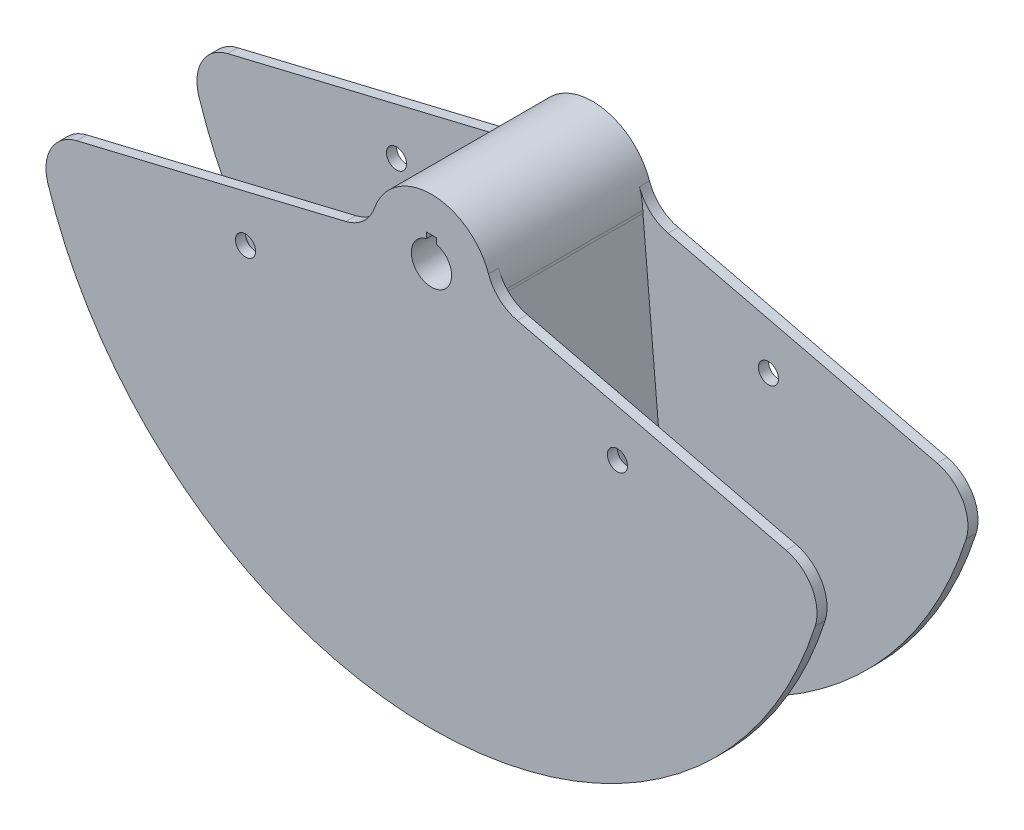
ISO-10303-21;
HEADER;
FILE_DESCRIPTION(('STEP AP214'),'2;1');
FILE_NAME('part.step','',(''),(''),'','','');
FILE_SCHEMA(('AUTOMOTIVE_DESIGN { 1 0 10303 214 1 1 1 1 }'));
ENDSEC;
DATA;
#1=APPLICATION_CONTEXT('core data for automotive mechanical design processes');
#2=APPLICATION_PROTOCOL_DEFINITION('international standard','automotive_design',2000,#1);
#3=PRODUCT_CONTEXT('',#1,'mechanical');
#4=PRODUCT('Part','Part','',(#3));
#5=PRODUCT_RELATED_PRODUCT_CATEGORY('part','',(#4));
#6=PRODUCT_DEFINITION_FORMATION('','',#4);
#7=PRODUCT_DEFINITION_CONTEXT('part definition',#1,'design');
#8=PRODUCT_DEFINITION('design','',#6,#7);
#9=PRODUCT_DEFINITION_SHAPE('','',#8);
#10=(LENGTH_UNIT() NAMED_UNIT(*) SI_UNIT(.MILLI.,.METRE.));
#11=(NAMED_UNIT(*) PLANE_ANGLE_UNIT() SI_UNIT($,.RADIAN.));
#12=(NAMED_UNIT(*) SI_UNIT($,.STERADIAN.) SOLID_ANGLE_UNIT());
#13=UNCERTAINTY_MEASURE_WITH_UNIT(LENGTH_MEASURE(1.E-05),#10,'distance_accuracy_value','');
#14=(GEOMETRIC_REPRESENTATION_CONTEXT(3) GLOBAL_UNCERTAINTY_ASSIGNED_CONTEXT((#13)) GLOBAL_UNIT_ASSIGNED_CONTEXT((#10,
#11,#12)) REPRESENTATION_CONTEXT('',''));
#15=CARTESIAN_POINT('',(0.,0.,0.));
#16=DIRECTION('',(0.,0.,1.));
#17=DIRECTION('',(1.,0.,0.));
#18=AXIS2_PLACEMENT_3D('',#15,#16,#17);
#19=CARTESIAN_POINT('',(0.,0.,44.45));
#20=DIRECTION('',(0.,0.,-1.));
#21=DIRECTION('',(-1.,0.,0.));
#22=AXIS2_PLACEMENT_3D('',#19,#20,#21);
#23=CYLINDRICAL_SURFACE('',#22,12.7);
#24=CARTESIAN_POINT('',(0.,0.,-50.8));
#25=DIRECTION('',(0.,0.,1.));
#26=DIRECTION('',(1.,0.,0.));
#27=AXIS2_PLACEMENT_3D('',#24,#25,#26);
#28=CIRCLE('',#27,12.7);
#29=CARTESIAN_POINT('',(-3.175,12.2967221242086,-50.8));
#30=VERTEX_POINT('',#29);
#31=CARTESIAN_POINT('',(3.175,12.2967221242086,-50.8));
#32=VERTEX_POINT('',#31);
#33=EDGE_CURVE('E246',#30,#32,#28,.T.);
#34=ORIENTED_EDGE('',*,*,#33,.F.);
#35=DIRECTION('',(0.,0.,-1.));
#36=VECTOR('',#35,1.);
#37=CARTESIAN_POINT('',(-3.175,12.2967221242085,44.45));
#38=LINE('',#37,#36);
#39=CARTESIAN_POINT('',(-3.175,12.2967221242085,50.8));
#40=VERTEX_POINT('',#39);
#41=EDGE_CURVE('E229',#30,#40,#38,.F.);
#42=ORIENTED_EDGE('',*,*,#41,.T.);
#43=CARTESIAN_POINT('',(0.,0.,50.8));
#44=DIRECTION('',(0.,0.,1.));
#45=DIRECTION('',(1.,0.,0.));
#46=AXIS2_PLACEMENT_3D('',#43,#44,#45);
#47=CIRCLE('',#46,12.7);
#48=CARTESIAN_POINT('',(3.175,12.2967221242085,50.8));
#49=VERTEX_POINT('',#48);
#50=EDGE_CURVE('E390',#40,#49,#47,.T.);
#51=ORIENTED_EDGE('',*,*,#50,.T.);
#52=DIRECTION('',(0.,0.,-1.));
#53=VECTOR('',#52,1.);
#54=CARTESIAN_POINT('',(3.175,12.2967221242085,44.45));
#55=LINE('',#54,#53);
#56=EDGE_CURVE('E211',#32,#49,#55,.F.);
#57=ORIENTED_EDGE('',*,*,#56,.F.);
#58=EDGE_LOOP('',(#34,#42,#51,#57));
#59=FACE_BOUND('',#58,.T.);
#60=ADVANCED_FACE('F37',(#59),#23,.F.);
#61=CARTESIAN_POINT('',(59.9721936818723,20.8706968015925,50.8));
#62=DIRECTION('',(0.,0.,-1.));
#63=DIRECTION('',(-1.,0.,0.));
#64=AXIS2_PLACEMENT_3D('',#61,#62,#63);
#65=PLANE('',#64);
#66=CARTESIAN_POINT('',(117.332700628933,-48.6007959103665,50.8));
#67=DIRECTION('',(0.,0.,1.));
#68=DIRECTION('',(1.,0.,0.));
#69=AXIS2_PLACEMENT_3D('',#66,#67,#68);
#70=CIRCLE('',#69,6.35000000000002);
#71=CARTESIAN_POINT('',(123.682700628933,-48.6007959103665,50.8));
#72=VERTEX_POINT('',#71);
#73=EDGE_CURVE('E483',#72,#72,#70,.T.);
#74=ORIENTED_EDGE('',*,*,#73,.F.);
#75=EDGE_LOOP('',(#74));
#76=FACE_BOUND('',#75,.T.);
#77=CARTESIAN_POINT('',(-117.332700628933,-48.6007959103665,50.8));
#78=DIRECTION('',(0.,0.,1.));
#79=DIRECTION('',(1.,0.,0.));
#80=AXIS2_PLACEMENT_3D('',#77,#78,#79);
#81=CIRCLE('',#80,6.35);
#82=CARTESIAN_POINT('',(-110.982700628933,-48.6007959103665,50.8));
#83=VERTEX_POINT('',#82);
#84=EDGE_CURVE('E479',#83,#83,#81,.T.);
#85=ORIENTED_EDGE('',*,*,#84,.F.);
#86=EDGE_LOOP('',(#85));
#87=FACE_BOUND('',#86,.T.);
#88=CARTESIAN_POINT('',(59.9721936818723,20.8706968015925,50.8));
#89=DIRECTION('',(0.,0.,-1.));
#90=DIRECTION('',(-1.,0.,0.));
#91=AXIS2_PLACEMENT_3D('',#88,#89,#90);
#92=CIRCLE('',#91,25.4);
#93=CARTESIAN_POINT('',(54.0426814399322,-3.82749917650851,50.8));
#94=VERTEX_POINT('',#93);
#95=CARTESIAN_POINT('',(35.9833162091234,12.5224180809555,50.8));
#96=VERTEX_POINT('',#95);
#97=EDGE_CURVE('E440',#94,#96,#92,.T.);
#98=ORIENTED_EDGE('',*,*,#97,.T.);
#99=CARTESIAN_POINT('',(0.,0.,50.8));
#100=DIRECTION('',(0.,0.,1.));
#101=DIRECTION('',(1.,0.,0.));
#102=AXIS2_PLACEMENT_3D('',#99,#100,#101);
#103=CIRCLE('',#102,38.1);
#104=CARTESIAN_POINT('',(-35.9833162091234,12.5224180809555,50.8));
#105=VERTEX_POINT('',#104);
#106=EDGE_CURVE('E445',#96,#105,#103,.T.);
#107=ORIENTED_EDGE('',*,*,#106,.T.);
#108=CARTESIAN_POINT('',(-59.9721936818723,20.8706968015924,50.8));
#109=DIRECTION('',(0.,0.,-1.));
#110=DIRECTION('',(1.,0.,0.));
#111=AXIS2_PLACEMENT_3D('',#108,#109,#110);
#112=CIRCLE('',#111,25.4);
#113=CARTESIAN_POINT('',(-54.0426814399322,-3.82749917650852,50.8));
#114=VERTEX_POINT('',#113);
#115=EDGE_CURVE('E475',#105,#114,#112,.T.);
#116=ORIENTED_EDGE('',*,*,#115,.T.);
#117=DIRECTION('',(-0.972369920397677,-0.233445363855906,0.));
#118=VECTOR('',#117,1.);
#119=CARTESIAN_POINT('',(-223.779910529454,-44.5778025060183,50.8));
#120=LINE('',#119,#118);
#121=CARTESIAN_POINT('',(-223.779910529454,-44.5778025060183,50.8));
#122=VERTEX_POINT('',#121);
#123=EDGE_CURVE('E473',#114,#122,#120,.T.);
#124=ORIENTED_EDGE('',*,*,#123,.T.);
#125=CARTESIAN_POINT('',(-217.850398287514,-69.2759984841193,50.8));
#126=DIRECTION('',(0.,0.,1.));
#127=DIRECTION('',(1.,0.,0.));
#128=AXIS2_PLACEMENT_3D('',#125,#126,#127);
#129=CIRCLE('',#128,25.4);
#130=CARTESIAN_POINT('',(-242.055998097237,-76.9733316490214,50.8));
#131=VERTEX_POINT('',#130);
#132=EDGE_CURVE('E469',#122,#131,#129,.T.);
#133=ORIENTED_EDGE('',*,*,#132,.T.);
#134=CARTESIAN_POINT('',(0.,0.,50.8));
#135=DIRECTION('',(0.,0.,1.));
#136=DIRECTION('',(1.,0.,0.));
#137=AXIS2_PLACEMENT_3D('',#134,#135,#136);
#138=CIRCLE('',#137,254.);
#139=CARTESIAN_POINT('',(242.055998097237,-76.9733316490214,50.8));
#140=VERTEX_POINT('',#139);
#141=EDGE_CURVE('E468',#131,#140,#138,.T.);
#142=ORIENTED_EDGE('',*,*,#141,.T.);
#143=CARTESIAN_POINT('',(217.850398287514,-69.2759984841192,50.8));
#144=DIRECTION('',(0.,0.,1.));
#145=DIRECTION('',(-1.,0.,0.));
#146=AXIS2_PLACEMENT_3D('',#143,#144,#145);
#147=CIRCLE('',#146,25.4);
#148=CARTESIAN_POINT('',(223.779910529454,-44.5778025060183,50.8));
#149=VERTEX_POINT('',#148);
#150=EDGE_CURVE('E467',#140,#149,#147,.T.);
#151=ORIENTED_EDGE('',*,*,#150,.T.);
#152=DIRECTION('',(-0.972369920397677,0.233445363855906,0.));
#153=VECTOR('',#152,1.);
#154=CARTESIAN_POINT('',(54.0426814399322,-3.82749917650851,50.8));
#155=LINE('',#154,#153);
#156=EDGE_CURVE('E413',#149,#94,#155,.T.);
#157=ORIENTED_EDGE('',*,*,#156,.T.);
#158=EDGE_LOOP('',(#98,#107,#116,#124,#133,#142,#151,#157));
#159=FACE_BOUND('',#158,.T.);
#160=DIRECTION('',(0.,-1.,0.));
#161=VECTOR('',#160,1.);
#162=CARTESIAN_POINT('',(-3.175,20.8706968015925,50.8));
#163=LINE('',#162,#161);
#164=CARTESIAN_POINT('',(-3.175,15.875,50.8));
#165=VERTEX_POINT('',#164);
#166=EDGE_CURVE('E228',#165,#40,#163,.T.);
#167=ORIENTED_EDGE('',*,*,#166,.F.);
#168=DIRECTION('',(1.,0.,0.));
#169=VECTOR('',#168,1.);
#170=CARTESIAN_POINT('',(59.9721936818723,15.875,50.8));
#171=LINE('',#170,#169);
#172=CARTESIAN_POINT('',(3.175,15.875,50.8));
#173=VERTEX_POINT('',#172);
#174=EDGE_CURVE('E216',#165,#173,#171,.T.);
#175=ORIENTED_EDGE('',*,*,#174,.T.);
#176=DIRECTION('',(0.,-1.,0.));
#177=VECTOR('',#176,1.);
#178=CARTESIAN_POINT('',(3.175,20.8706968015925,50.8));
#179=LINE('',#178,#177);
#180=EDGE_CURVE('E208',#173,#49,#179,.T.);
#181=ORIENTED_EDGE('',*,*,#180,.T.);
#182=ORIENTED_EDGE('',*,*,#50,.F.);
#183=EDGE_LOOP('',(#167,#175,#181,#182));
#184=FACE_BOUND('',#183,.T.);
#185=ADVANCED_FACE('F227',(#76,#87,#159,#184),#65,.F.);
#186=CARTESIAN_POINT('',(59.9721936818723,20.8706968015925,-50.8));
#187=DIRECTION('',(0.,0.,1.));
#188=DIRECTION('',(-1.,0.,0.));
#189=AXIS2_PLACEMENT_3D('',#186,#187,#188);
#190=PLANE('',#189);
#191=CARTESIAN_POINT('',(59.9721936818723,20.8706968015925,-50.8));
#192=DIRECTION('',(0.,0.,-1.));
#193=DIRECTION('',(-1.,0.,0.));
#194=AXIS2_PLACEMENT_3D('',#191,#192,#193);
#195=CIRCLE('',#194,25.4);
#196=CARTESIAN_POINT('',(54.0426814399322,-3.82749917650851,-50.8));
#197=VERTEX_POINT('',#196);
#198=CARTESIAN_POINT('',(35.9833162091234,12.5224180809555,-50.8));
#199=VERTEX_POINT('',#198);
#200=EDGE_CURVE('E252',#197,#199,#195,.T.);
#201=ORIENTED_EDGE('',*,*,#200,.F.);
#202=DIRECTION('',(-0.972369920397677,0.233445363855906,0.));
#203=VECTOR('',#202,1.);
#204=CARTESIAN_POINT('',(54.0426814399322,-3.82749917650851,-50.8));
#205=LINE('',#204,#203);
#206=CARTESIAN_POINT('',(223.779910529454,-44.5778025060183,-50.8));
#207=VERTEX_POINT('',#206);
#208=EDGE_CURVE('E255',#207,#197,#205,.T.);
#209=ORIENTED_EDGE('',*,*,#208,.F.);
#210=CARTESIAN_POINT('',(217.850398287514,-69.2759984841192,-50.8));
#211=DIRECTION('',(0.,0.,1.));
#212=DIRECTION('',(-1.,0.,0.));
#213=AXIS2_PLACEMENT_3D('',#210,#211,#212);
#214=CIRCLE('',#213,25.4);
#215=CARTESIAN_POINT('',(242.055998097237,-76.9733316490214,-50.8));
#216=VERTEX_POINT('',#215);
#217=EDGE_CURVE('E259',#216,#207,#214,.T.);
#218=ORIENTED_EDGE('',*,*,#217,.F.);
#219=CARTESIAN_POINT('',(0.,0.,-50.8));
#220=DIRECTION('',(0.,0.,1.));
#221=DIRECTION('',(1.,0.,0.));
#222=AXIS2_PLACEMENT_3D('',#219,#220,#221);
#223=CIRCLE('',#222,254.);
#224=CARTESIAN_POINT('',(-242.055998097237,-76.9733316490214,-50.8));
#225=VERTEX_POINT('',#224);
#226=EDGE_CURVE('E262',#225,#216,#223,.T.);
#227=ORIENTED_EDGE('',*,*,#226,.F.);
#228=CARTESIAN_POINT('',(-217.850398287514,-69.2759984841193,-50.8));
#229=DIRECTION('',(0.,0.,1.));
#230=DIRECTION('',(1.,0.,0.));
#231=AXIS2_PLACEMENT_3D('',#228,#229,#230);
#232=CIRCLE('',#231,25.4);
#233=CARTESIAN_POINT('',(-223.779910529454,-44.5778025060183,-50.8));
#234=VERTEX_POINT('',#233);
#235=EDGE_CURVE('E265',#234,#225,#232,.T.);
#236=ORIENTED_EDGE('',*,*,#235,.F.);
#237=DIRECTION('',(-0.972369920397677,-0.233445363855906,0.));
#238=VECTOR('',#237,1.);
#239=CARTESIAN_POINT('',(-223.779910529454,-44.5778025060183,-50.8));
#240=LINE('',#239,#238);
#241=CARTESIAN_POINT('',(-54.0426814399322,-3.82749917650852,-50.8));
#242=VERTEX_POINT('',#241);
#243=EDGE_CURVE('E268',#242,#234,#240,.T.);
#244=ORIENTED_EDGE('',*,*,#243,.F.);
#245=CARTESIAN_POINT('',(-59.9721936818723,20.8706968015924,-50.8));
#246=DIRECTION('',(0.,0.,-1.));
#247=DIRECTION('',(1.,0.,0.));
#248=AXIS2_PLACEMENT_3D('',#245,#246,#247);
#249=CIRCLE('',#248,25.4);
#250=CARTESIAN_POINT('',(-35.9833162091234,12.5224180809555,-50.8));
#251=VERTEX_POINT('',#250);
#252=EDGE_CURVE('E271',#251,#242,#249,.T.);
#253=ORIENTED_EDGE('',*,*,#252,.F.);
#254=CARTESIAN_POINT('',(0.,0.,-50.8));
#255=DIRECTION('',(0.,0.,1.));
#256=DIRECTION('',(1.,0.,0.));
#257=AXIS2_PLACEMENT_3D('',#254,#255,#256);
#258=CIRCLE('',#257,38.1);
#259=EDGE_CURVE('E274',#199,#251,#258,.T.);
#260=ORIENTED_EDGE('',*,*,#259,.F.);
#261=EDGE_LOOP('',(#201,#209,#218,#227,#236,#244,#253,#260));
#262=FACE_BOUND('',#261,.T.);
#263=CARTESIAN_POINT('',(-117.332700628933,-48.6007959103665,-50.8));
#264=DIRECTION('',(0.,0.,1.));
#265=DIRECTION('',(1.,0.,0.));
#266=AXIS2_PLACEMENT_3D('',#263,#264,#265);
#267=CIRCLE('',#266,6.35);
#268=CARTESIAN_POINT('',(-110.982700628933,-48.6007959103665,-50.8));
#269=VERTEX_POINT('',#268);
#270=EDGE_CURVE('E243',#269,#269,#267,.T.);
#271=ORIENTED_EDGE('',*,*,#270,.T.);
#272=EDGE_LOOP('',(#271));
#273=FACE_BOUND('',#272,.T.);
#274=CARTESIAN_POINT('',(117.332700628933,-48.6007959103665,-50.8));
#275=DIRECTION('',(0.,0.,1.));
#276=DIRECTION('',(1.,0.,0.));
#277=AXIS2_PLACEMENT_3D('',#274,#275,#276);
#278=CIRCLE('',#277,6.35000000000002);
#279=CARTESIAN_POINT('',(123.682700628933,-48.6007959103665,-50.8));
#280=VERTEX_POINT('',#279);
#281=EDGE_CURVE('E237',#280,#280,#278,.T.);
#282=ORIENTED_EDGE('',*,*,#281,.T.);
#283=EDGE_LOOP('',(#282));
#284=FACE_BOUND('',#283,.T.);
#285=DIRECTION('',(0.,1.,0.));
#286=VECTOR('',#285,1.);
#287=CARTESIAN_POINT('',(-3.175,20.8706968015925,-50.8));
#288=LINE('',#287,#286);
#289=CARTESIAN_POINT('',(-3.175,15.875,-50.8));
#290=VERTEX_POINT('',#289);
#291=EDGE_CURVE('E11',#30,#290,#288,.T.);
#292=ORIENTED_EDGE('',*,*,#291,.F.);
#293=ORIENTED_EDGE('',*,*,#33,.T.);
#294=DIRECTION('',(0.,1.,0.));
#295=VECTOR('',#294,1.);
#296=CARTESIAN_POINT('',(3.175,20.8706968015925,-50.8));
#297=LINE('',#296,#295);
#298=CARTESIAN_POINT('',(3.175,15.875,-50.8));
#299=VERTEX_POINT('',#298);
#300=EDGE_CURVE('E375',#32,#299,#297,.T.);
#301=ORIENTED_EDGE('',*,*,#300,.T.);
#302=DIRECTION('',(-1.,0.,0.));
#303=VECTOR('',#302,1.);
#304=CARTESIAN_POINT('',(59.9721936818723,15.875,-50.8));
#305=LINE('',#304,#303);
#306=EDGE_CURVE('E45',#299,#290,#305,.T.);
#307=ORIENTED_EDGE('',*,*,#306,.T.);
#308=EDGE_LOOP('',(#292,#293,#301,#307));
#309=FACE_BOUND('',#308,.T.);
#310=ADVANCED_FACE('F495',(#262,#273,#284,#309),#190,.F.);
#311=CARTESIAN_POINT('',(0.,0.,44.45));
#312=DIRECTION('',(0.,0.,-1.));
#313=DIRECTION('',(-1.,0.,0.));
#314=AXIS2_PLACEMENT_3D('',#311,#312,#313);
#315=CYLINDRICAL_SURFACE('',#314,254.);
#316=DIRECTION('',(0.,0.,-1.));
#317=VECTOR('',#316,1.);
#318=CARTESIAN_POINT('',(-59.6995953012024,-246.884504011233,44.45));
#319=LINE('',#318,#317);
#320=CARTESIAN_POINT('',(-59.6995953012024,-246.884504011233,44.45));
#321=VERTEX_POINT('',#320);
#322=CARTESIAN_POINT('',(-59.6995953012024,-246.884504011233,-44.45));
#323=VERTEX_POINT('',#322);
#324=EDGE_CURVE('E327',#321,#323,#319,.T.);
#325=ORIENTED_EDGE('',*,*,#324,.T.);
#326=CARTESIAN_POINT('',(0.,0.,-44.45));
#327=DIRECTION('',(0.,0.,1.));
#328=DIRECTION('',(1.,0.,0.));
#329=AXIS2_PLACEMENT_3D('',#326,#327,#328);
#330=CIRCLE('',#329,254.);
#331=CARTESIAN_POINT('',(-242.055998097237,-76.9733316490214,-44.45));
#332=VERTEX_POINT('',#331);
#333=EDGE_CURVE('E293',#332,#323,#330,.T.);
#334=ORIENTED_EDGE('',*,*,#333,.F.);
#335=DIRECTION('',(0.,0.,1.));
#336=VECTOR('',#335,1.);
#337=CARTESIAN_POINT('',(-242.055998097237,-76.9733316490214,-50.8));
#338=LINE('',#337,#336);
#339=EDGE_CURVE('E303',#225,#332,#338,.T.);
#340=ORIENTED_EDGE('',*,*,#339,.F.);
#341=ORIENTED_EDGE('',*,*,#226,.T.);
#342=DIRECTION('',(0.,0.,1.));
#343=VECTOR('',#342,1.);
#344=CARTESIAN_POINT('',(242.055998097237,-76.9733316490214,-50.8));
#345=LINE('',#344,#343);
#346=CARTESIAN_POINT('',(242.055998097237,-76.9733316490214,-44.45));
#347=VERTEX_POINT('',#346);
#348=EDGE_CURVE('E300',#216,#347,#345,.T.);
#349=ORIENTED_EDGE('',*,*,#348,.T.);
#350=CARTESIAN_POINT('',(59.6995953012025,-246.884504011233,-44.45));
#351=VERTEX_POINT('',#350);
#352=EDGE_CURVE('E284',#351,#347,#330,.T.);
#353=ORIENTED_EDGE('',*,*,#352,.F.);
#354=DIRECTION('',(0.,0.,-1.));
#355=VECTOR('',#354,1.);
#356=CARTESIAN_POINT('',(59.6995953012025,-246.884504011233,44.45));
#357=LINE('',#356,#355);
#358=CARTESIAN_POINT('',(59.6995953012025,-246.884504011233,44.45));
#359=VERTEX_POINT('',#358);
#360=EDGE_CURVE('E372',#359,#351,#357,.T.);
#361=ORIENTED_EDGE('',*,*,#360,.F.);
#362=CARTESIAN_POINT('',(0.,0.,44.45));
#363=DIRECTION('',(0.,0.,1.));
#364=DIRECTION('',(1.,0.,0.));
#365=AXIS2_PLACEMENT_3D('',#362,#363,#364);
#366=CIRCLE('',#365,254.);
#367=CARTESIAN_POINT('',(242.055998097237,-76.9733316490214,44.45));
#368=VERTEX_POINT('',#367);
#369=EDGE_CURVE('E410',#359,#368,#366,.T.);
#370=ORIENTED_EDGE('',*,*,#369,.T.);
#371=DIRECTION('',(0.,0.,-1.));
#372=VECTOR('',#371,1.);
#373=CARTESIAN_POINT('',(242.055998097237,-76.9733316490214,50.8));
#374=LINE('',#373,#372);
#375=EDGE_CURVE('E431',#140,#368,#374,.T.);
#376=ORIENTED_EDGE('',*,*,#375,.F.);
#377=ORIENTED_EDGE('',*,*,#141,.F.);
#378=DIRECTION('',(0.,0.,-1.));
#379=VECTOR('',#378,1.);
#380=CARTESIAN_POINT('',(-242.055998097237,-76.9733316490214,50.8));
#381=LINE('',#380,#379);
#382=CARTESIAN_POINT('',(-242.055998097237,-76.9733316490214,44.45));
#383=VERTEX_POINT('',#382);
#384=EDGE_CURVE('E429',#131,#383,#381,.T.);
#385=ORIENTED_EDGE('',*,*,#384,.T.);
#386=EDGE_CURVE('E330',#383,#321,#366,.T.);
#387=ORIENTED_EDGE('',*,*,#386,.T.);
#388=EDGE_LOOP('',(#325,#334,#340,#341,#349,#353,#361,#370,#376,#377,#385,#387));
#389=FACE_BOUND('',#388,.T.);
#390=ADVANCED_FACE('F39',(#389),#315,.T.);
#391=CARTESIAN_POINT('',(38.1843597954435,-0.964236874169337,44.45));
#392=DIRECTION('',(-0.996194698091746,-0.0871557427476545,0.));
#393=DIRECTION('',(0.0871557427476545,-0.996194698091746,0.));
#394=AXIS2_PLACEMENT_3D('',#391,#392,#393);
#395=PLANE('',#394);
#396=DIRECTION('',(-0.0871557427476544,0.996194698091746,0.));
#397=VECTOR('',#396,1.);
#398=CARTESIAN_POINT('',(38.1843597954435,-0.964236874169337,-44.45));
#399=LINE('',#398,#397);
#400=CARTESIAN_POINT('',(38.1843597954435,-0.964236874169344,-44.45));
#401=VERTEX_POINT('',#400);
#402=EDGE_CURVE('E358',#351,#401,#399,.T.);
#403=ORIENTED_EDGE('',*,*,#402,.T.);
#404=DIRECTION('',(0.,0.,-1.));
#405=VECTOR('',#404,1.);
#406=CARTESIAN_POINT('',(38.1843597954435,-0.964236874169344,44.45));
#407=LINE('',#406,#405);
#408=CARTESIAN_POINT('',(38.1843597954435,-0.964236874169344,44.45));
#409=VERTEX_POINT('',#408);
#410=EDGE_CURVE('E376',#409,#401,#407,.T.);
#411=ORIENTED_EDGE('',*,*,#410,.F.);
#412=DIRECTION('',(-0.0871557427476544,0.996194698091746,0.));
#413=VECTOR('',#412,1.);
#414=CARTESIAN_POINT('',(38.1843597954435,-0.964236874169337,44.45));
#415=LINE('',#414,#413);
#416=EDGE_CURVE('E379',#359,#409,#415,.T.);
#417=ORIENTED_EDGE('',*,*,#416,.F.);
#418=ORIENTED_EDGE('',*,*,#360,.T.);
#419=EDGE_LOOP('',(#403,#411,#417,#418));
#420=FACE_BOUND('',#419,.T.);
#421=ADVANCED_FACE('F548',(#420),#395,.F.);
#422=CARTESIAN_POINT('',(63.4877051269738,1.24951899162109,44.45));
#423=DIRECTION('',(0.,0.,-1.));
#424=DIRECTION('',(-1.,0.,0.));
#425=AXIS2_PLACEMENT_3D('',#422,#423,#424);
#426=CYLINDRICAL_SURFACE('',#425,25.4);
#427=CARTESIAN_POINT('',(63.4877051269738,1.24951899162109,-44.45));
#428=DIRECTION('',(0.,0.,-1.));
#429=DIRECTION('',(-1.,0.,0.));
#430=AXIS2_PLACEMENT_3D('',#427,#428,#429);
#431=CIRCLE('',#430,25.4);
#432=CARTESIAN_POINT('',(38.0926230761843,0.749711394972652,-44.45));
#433=VERTEX_POINT('',#432);
#434=EDGE_CURVE('E354',#401,#433,#431,.T.);
#435=ORIENTED_EDGE('',*,*,#434,.T.);
#436=DIRECTION('',(0.,0.,-1.));
#437=VECTOR('',#436,1.);
#438=CARTESIAN_POINT('',(38.0926230761843,0.749711394972652,44.45));
#439=LINE('',#438,#437);
#440=CARTESIAN_POINT('',(38.0926230761843,0.749711394972652,44.45));
#441=VERTEX_POINT('',#440);
#442=EDGE_CURVE('E562',#441,#433,#439,.T.);
#443=ORIENTED_EDGE('',*,*,#442,.F.);
#444=CARTESIAN_POINT('',(63.4877051269738,1.24951899162109,44.45));
#445=DIRECTION('',(0.,0.,-1.));
#446=DIRECTION('',(-1.,0.,0.));
#447=AXIS2_PLACEMENT_3D('',#444,#445,#446);
#448=CIRCLE('',#447,25.4);
#449=EDGE_CURVE('E382',#409,#441,#448,.T.);
#450=ORIENTED_EDGE('',*,*,#449,.F.);
#451=ORIENTED_EDGE('',*,*,#410,.T.);
#452=EDGE_LOOP('',(#435,#443,#450,#451));
#453=FACE_BOUND('',#452,.T.);
#454=ADVANCED_FACE('F546',(#453),#426,.F.);
#455=CARTESIAN_POINT('',(0.,0.,44.45));
#456=DIRECTION('',(0.,0.,-1.));
#457=DIRECTION('',(-1.,0.,0.));
#458=AXIS2_PLACEMENT_3D('',#455,#456,#457);
#459=CYLINDRICAL_SURFACE('',#458,38.1);
#460=CARTESIAN_POINT('',(0.,0.,-44.45));
#461=DIRECTION('',(0.,0.,1.));
#462=DIRECTION('',(1.,0.,0.));
#463=AXIS2_PLACEMENT_3D('',#460,#461,#462);
#464=CIRCLE('',#463,38.1);
#465=CARTESIAN_POINT('',(35.9833162091234,12.5224180809555,-44.45));
#466=VERTEX_POINT('',#465);
#467=EDGE_CURVE('E367',#433,#466,#464,.T.);
#468=ORIENTED_EDGE('',*,*,#467,.T.);
#469=DIRECTION('',(0.,0.,1.));
#470=VECTOR('',#469,1.);
#471=CARTESIAN_POINT('',(35.9833162091234,12.5224180809555,-50.8));
#472=LINE('',#471,#470);
#473=EDGE_CURVE('E277',#199,#466,#472,.T.);
#474=ORIENTED_EDGE('',*,*,#473,.F.);
#475=ORIENTED_EDGE('',*,*,#259,.T.);
#476=DIRECTION('',(0.,0.,1.));
#477=VECTOR('',#476,1.);
#478=CARTESIAN_POINT('',(-35.9833162091234,12.5224180809555,-50.8));
#479=LINE('',#478,#477);
#480=CARTESIAN_POINT('',(-35.9833162091234,12.5224180809555,-44.45));
#481=VERTEX_POINT('',#480);
#482=EDGE_CURVE('E308',#251,#481,#479,.T.);
#483=ORIENTED_EDGE('',*,*,#482,.T.);
#484=CARTESIAN_POINT('',(-38.0926230761843,0.74971139497264,-44.45));
#485=VERTEX_POINT('',#484);
#486=EDGE_CURVE('E357',#481,#485,#464,.T.);
#487=ORIENTED_EDGE('',*,*,#486,.T.);
#488=DIRECTION('',(0.,0.,-1.));
#489=VECTOR('',#488,1.);
#490=CARTESIAN_POINT('',(-38.0926230761843,0.74971139497264,44.45));
#491=LINE('',#490,#489);
#492=CARTESIAN_POINT('',(-38.0926230761843,0.74971139497264,44.45));
#493=VERTEX_POINT('',#492);
#494=EDGE_CURVE('E338',#493,#485,#491,.T.);
#495=ORIENTED_EDGE('',*,*,#494,.F.);
#496=CARTESIAN_POINT('',(0.,0.,44.45));
#497=DIRECTION('',(0.,0.,1.));
#498=DIRECTION('',(1.,0.,0.));
#499=AXIS2_PLACEMENT_3D('',#496,#497,#498);
#500=CIRCLE('',#499,38.1);
#501=CARTESIAN_POINT('',(-35.9833162091234,12.5224180809555,44.45));
#502=VERTEX_POINT('',#501);
#503=EDGE_CURVE('E60',#502,#493,#500,.T.);
#504=ORIENTED_EDGE('',*,*,#503,.F.);
#505=DIRECTION('',(0.,0.,-1.));
#506=VECTOR('',#505,1.);
#507=CARTESIAN_POINT('',(-35.9833162091234,12.5224180809555,50.8));
#508=LINE('',#507,#506);
#509=EDGE_CURVE('E349',#105,#502,#508,.T.);
#510=ORIENTED_EDGE('',*,*,#509,.F.);
#511=ORIENTED_EDGE('',*,*,#106,.F.);
#512=DIRECTION('',(0.,0.,-1.));
#513=VECTOR('',#512,1.);
#514=CARTESIAN_POINT('',(35.9833162091234,12.5224180809555,50.8));
#515=LINE('',#514,#513);
#516=CARTESIAN_POINT('',(35.9833162091234,12.5224180809555,44.45));
#517=VERTEX_POINT('',#516);
#518=EDGE_CURVE('E393',#96,#517,#515,.T.);
#519=ORIENTED_EDGE('',*,*,#518,.T.);
#520=EDGE_CURVE('E461',#441,#517,#500,.T.);
#521=ORIENTED_EDGE('',*,*,#520,.F.);
#522=ORIENTED_EDGE('',*,*,#442,.T.);
#523=EDGE_LOOP('',(#468,#474,#475,#483,#487,#495,#504,#510,#511,#519,#521,#522));
#524=FACE_BOUND('',#523,.T.);
#525=ADVANCED_FACE('F542',(#524),#459,.T.);
#526=CARTESIAN_POINT('',(-63.4877051269738,1.24951899162107,44.45));
#527=DIRECTION('',(0.,0.,-1.));
#528=DIRECTION('',(-1.,0.,0.));
#529=AXIS2_PLACEMENT_3D('',#526,#527,#528);
#530=CYLINDRICAL_SURFACE('',#529,25.4);
#531=CARTESIAN_POINT('',(-63.4877051269738,1.24951899162107,-44.45));
#532=DIRECTION('',(0.,0.,-1.));
#533=DIRECTION('',(1.,0.,0.));
#534=AXIS2_PLACEMENT_3D('',#531,#532,#533);
#535=CIRCLE('',#534,25.4);
#536=CARTESIAN_POINT('',(-38.1843597954435,-0.964236874169347,-44.45));
#537=VERTEX_POINT('',#536);
#538=EDGE_CURVE('E361',#485,#537,#535,.T.);
#539=ORIENTED_EDGE('',*,*,#538,.T.);
#540=DIRECTION('',(0.,0.,-1.));
#541=VECTOR('',#540,1.);
#542=CARTESIAN_POINT('',(-38.1843597954435,-0.964236874169347,44.45));
#543=LINE('',#542,#541);
#544=CARTESIAN_POINT('',(-38.1843597954435,-0.964236874169347,44.45));
#545=VERTEX_POINT('',#544);
#546=EDGE_CURVE('E334',#545,#537,#543,.T.);
#547=ORIENTED_EDGE('',*,*,#546,.F.);
#548=CARTESIAN_POINT('',(-63.4877051269738,1.24951899162107,44.45));
#549=DIRECTION('',(0.,0.,-1.));
#550=DIRECTION('',(1.,0.,0.));
#551=AXIS2_PLACEMENT_3D('',#548,#549,#550);
#552=CIRCLE('',#551,25.4);
#553=EDGE_CURVE('E340',#493,#545,#552,.T.);
#554=ORIENTED_EDGE('',*,*,#553,.F.);
#555=ORIENTED_EDGE('',*,*,#494,.T.);
#556=EDGE_LOOP('',(#539,#547,#554,#555));
#557=FACE_BOUND('',#556,.T.);
#558=ADVANCED_FACE('F539',(#557),#530,.F.);
#559=CARTESIAN_POINT('',(-59.6995953012024,-246.884504011233,44.45));
#560=DIRECTION('',(0.996194698091746,-0.0871557427476542,0.));
#561=DIRECTION('',(0.0871557427476542,0.996194698091746,0.));
#562=AXIS2_PLACEMENT_3D('',#559,#560,#561);
#563=PLANE('',#562);
#564=DIRECTION('',(-0.0871557427476543,-0.996194698091746,0.));
#565=VECTOR('',#564,1.);
#566=CARTESIAN_POINT('',(-59.6995953012024,-246.884504011233,-44.45));
#567=LINE('',#566,#565);
#568=EDGE_CURVE('E383',#537,#323,#567,.T.);
#569=ORIENTED_EDGE('',*,*,#568,.T.);
#570=ORIENTED_EDGE('',*,*,#324,.F.);
#571=DIRECTION('',(-0.0871557427476543,-0.996194698091746,0.));
#572=VECTOR('',#571,1.);
#573=CARTESIAN_POINT('',(-59.6995953012024,-246.884504011233,44.45));
#574=LINE('',#573,#572);
#575=EDGE_CURVE('E335',#545,#321,#574,.T.);
#576=ORIENTED_EDGE('',*,*,#575,.F.);
#577=ORIENTED_EDGE('',*,*,#546,.T.);
#578=EDGE_LOOP('',(#569,#570,#576,#577));
#579=FACE_BOUND('',#578,.T.);
#580=ADVANCED_FACE('F536',(#579),#563,.F.);
#581=CARTESIAN_POINT('',(59.9721936818723,20.8706968015925,44.45));
#582=DIRECTION('',(0.,0.,-1.));
#583=DIRECTION('',(-1.,0.,0.));
#584=AXIS2_PLACEMENT_3D('',#581,#582,#583);
#585=PLANE('',#584);
#586=CARTESIAN_POINT('',(117.332700628933,-48.6007959103665,44.45));
#587=DIRECTION('',(0.,0.,1.));
#588=DIRECTION('',(1.,0.,0.));
#589=AXIS2_PLACEMENT_3D('',#586,#587,#588);
#590=CIRCLE('',#589,6.35000000000002);
#591=CARTESIAN_POINT('',(123.682700628933,-48.6007959103665,44.45));
#592=VERTEX_POINT('',#591);
#593=EDGE_CURVE('E297',#592,#592,#590,.T.);
#594=ORIENTED_EDGE('',*,*,#593,.T.);
#595=EDGE_LOOP('',(#594));
#596=FACE_BOUND('',#595,.T.);
#597=ORIENTED_EDGE('',*,*,#369,.F.);
#598=ORIENTED_EDGE('',*,*,#416,.T.);
#599=ORIENTED_EDGE('',*,*,#449,.T.);
#600=ORIENTED_EDGE('',*,*,#520,.T.);
#601=CARTESIAN_POINT('',(59.9721936818723,20.8706968015925,44.45));
#602=DIRECTION('',(0.,0.,-1.));
#603=DIRECTION('',(-1.,0.,0.));
#604=AXIS2_PLACEMENT_3D('',#601,#602,#603);
#605=CIRCLE('',#604,25.4);
#606=CARTESIAN_POINT('',(54.0426814399322,-3.82749917650851,44.45));
#607=VERTEX_POINT('',#606);
#608=EDGE_CURVE('E386',#607,#517,#605,.T.);
#609=ORIENTED_EDGE('',*,*,#608,.F.);
#610=DIRECTION('',(-0.972369920397677,0.233445363855906,0.));
#611=VECTOR('',#610,1.);
#612=CARTESIAN_POINT('',(54.0426814399322,-3.82749917650851,44.45));
#613=LINE('',#612,#611);
#614=CARTESIAN_POINT('',(223.779910529454,-44.5778025060183,44.45));
#615=VERTEX_POINT('',#614);
#616=EDGE_CURVE('E439',#615,#607,#613,.T.);
#617=ORIENTED_EDGE('',*,*,#616,.F.);
#618=CARTESIAN_POINT('',(217.850398287514,-69.2759984841192,44.45));
#619=DIRECTION('',(0.,0.,1.));
#620=DIRECTION('',(-1.,0.,0.));
#621=AXIS2_PLACEMENT_3D('',#618,#619,#620);
#622=CIRCLE('',#621,25.4);
#623=EDGE_CURVE('E418',#368,#615,#622,.T.);
#624=ORIENTED_EDGE('',*,*,#623,.F.);
#625=EDGE_LOOP('',(#597,#598,#599,#600,#609,#617,#624));
#626=FACE_BOUND('',#625,.T.);
#627=ADVANCED_FACE('F458',(#596,#626),#585,.T.);
#628=CARTESIAN_POINT('',(-117.332700628933,-48.6007959103665,44.45));
#629=DIRECTION('',(0.,0.,1.));
#630=DIRECTION('',(1.,0.,0.));
#631=AXIS2_PLACEMENT_3D('',#628,#629,#630);
#632=CIRCLE('',#631,6.35);
#633=CARTESIAN_POINT('',(-110.982700628933,-48.6007959103665,44.45));
#634=VERTEX_POINT('',#633);
#635=EDGE_CURVE('E480',#634,#634,#632,.T.);
#636=ORIENTED_EDGE('',*,*,#635,.T.);
#637=EDGE_LOOP('',(#636));
#638=FACE_BOUND('',#637,.T.);
#639=CARTESIAN_POINT('',(-59.9721936818723,20.8706968015924,44.45));
#640=DIRECTION('',(0.,0.,-1.));
#641=DIRECTION('',(1.,0.,0.));
#642=AXIS2_PLACEMENT_3D('',#639,#640,#641);
#643=CIRCLE('',#642,25.4);
#644=CARTESIAN_POINT('',(-54.0426814399322,-3.82749917650852,44.45));
#645=VERTEX_POINT('',#644);
#646=EDGE_CURVE('E389',#502,#645,#643,.T.);
#647=ORIENTED_EDGE('',*,*,#646,.F.);
#648=ORIENTED_EDGE('',*,*,#503,.T.);
#649=ORIENTED_EDGE('',*,*,#553,.T.);
#650=ORIENTED_EDGE('',*,*,#575,.T.);
#651=ORIENTED_EDGE('',*,*,#386,.F.);
#652=CARTESIAN_POINT('',(-217.850398287514,-69.2759984841193,44.45));
#653=DIRECTION('',(0.,0.,1.));
#654=DIRECTION('',(1.,0.,0.));
#655=AXIS2_PLACEMENT_3D('',#652,#653,#654);
#656=CIRCLE('',#655,25.4);
#657=CARTESIAN_POINT('',(-223.779910529454,-44.5778025060183,44.45));
#658=VERTEX_POINT('',#657);
#659=EDGE_CURVE('E404',#658,#383,#656,.T.);
#660=ORIENTED_EDGE('',*,*,#659,.F.);
#661=DIRECTION('',(-0.972369920397677,-0.233445363855906,0.));
#662=VECTOR('',#661,1.);
#663=CARTESIAN_POINT('',(-223.779910529454,-44.5778025060183,44.45));
#664=LINE('',#663,#662);
#665=EDGE_CURVE('E398',#645,#658,#664,.T.);
#666=ORIENTED_EDGE('',*,*,#665,.F.);
#667=EDGE_LOOP('',(#647,#648,#649,#650,#651,#660,#666));
#668=FACE_BOUND('',#667,.T.);
#669=ADVANCED_FACE('F505',(#638,#668),#585,.T.);
#670=CARTESIAN_POINT('',(59.9721936818723,20.8706968015925,50.8));
#671=DIRECTION('',(0.,0.,-1.));
#672=DIRECTION('',(-1.,0.,0.));
#673=AXIS2_PLACEMENT_3D('',#670,#671,#672);
#674=CYLINDRICAL_SURFACE('',#673,25.4);
#675=ORIENTED_EDGE('',*,*,#608,.T.);
#676=ORIENTED_EDGE('',*,*,#518,.F.);
#677=ORIENTED_EDGE('',*,*,#97,.F.);
#678=DIRECTION('',(0.,0.,-1.));
#679=VECTOR('',#678,1.);
#680=CARTESIAN_POINT('',(54.0426814399322,-3.82749917650851,50.8));
#681=LINE('',#680,#679);
#682=EDGE_CURVE('E437',#94,#607,#681,.T.);
#683=ORIENTED_EDGE('',*,*,#682,.T.);
#684=EDGE_LOOP('',(#675,#676,#677,#683));
#685=FACE_BOUND('',#684,.T.);
#686=ADVANCED_FACE('F464',(#685),#674,.F.);
#687=CARTESIAN_POINT('',(-59.9721936818723,20.8706968015924,50.8));
#688=DIRECTION('',(0.,0.,-1.));
#689=DIRECTION('',(-1.,0.,0.));
#690=AXIS2_PLACEMENT_3D('',#687,#688,#689);
#691=CYLINDRICAL_SURFACE('',#690,25.4);
#692=ORIENTED_EDGE('',*,*,#646,.T.);
#693=DIRECTION('',(0.,0.,-1.));
#694=VECTOR('',#693,1.);
#695=CARTESIAN_POINT('',(-54.0426814399322,-3.82749917650852,50.8));
#696=LINE('',#695,#694);
#697=EDGE_CURVE('E425',#114,#645,#696,.T.);
#698=ORIENTED_EDGE('',*,*,#697,.F.);
#699=ORIENTED_EDGE('',*,*,#115,.F.);
#700=ORIENTED_EDGE('',*,*,#509,.T.);
#701=EDGE_LOOP('',(#692,#698,#699,#700));
#702=FACE_BOUND('',#701,.T.);
#703=ADVANCED_FACE('F520',(#702),#691,.F.);
#704=CARTESIAN_POINT('',(-223.779910529454,-44.5778025060183,50.8));
#705=DIRECTION('',(0.233445363855906,-0.972369920397676,0.));
#706=DIRECTION('',(0.972369920397676,0.233445363855906,0.));
#707=AXIS2_PLACEMENT_3D('',#704,#705,#706);
#708=PLANE('',#707);
#709=ORIENTED_EDGE('',*,*,#665,.T.);
#710=DIRECTION('',(0.,0.,-1.));
#711=VECTOR('',#710,1.);
#712=CARTESIAN_POINT('',(-223.779910529454,-44.5778025060183,50.8));
#713=LINE('',#712,#711);
#714=EDGE_CURVE('E427',#122,#658,#713,.T.);
#715=ORIENTED_EDGE('',*,*,#714,.F.);
#716=ORIENTED_EDGE('',*,*,#123,.F.);
#717=ORIENTED_EDGE('',*,*,#697,.T.);
#718=EDGE_LOOP('',(#709,#715,#716,#717));
#719=FACE_BOUND('',#718,.T.);
#720=ADVANCED_FACE('F518',(#719),#708,.F.);
#721=CARTESIAN_POINT('',(-217.850398287514,-69.2759984841193,50.8));
#722=DIRECTION('',(0.,0.,-1.));
#723=DIRECTION('',(-1.,0.,0.));
#724=AXIS2_PLACEMENT_3D('',#721,#722,#723);
#725=CYLINDRICAL_SURFACE('',#724,25.4);
#726=ORIENTED_EDGE('',*,*,#659,.T.);
#727=ORIENTED_EDGE('',*,*,#384,.F.);
#728=ORIENTED_EDGE('',*,*,#132,.F.);
#729=ORIENTED_EDGE('',*,*,#714,.T.);
#730=EDGE_LOOP('',(#726,#727,#728,#729));
#731=FACE_BOUND('',#730,.T.);
#732=ADVANCED_FACE('F513',(#731),#725,.T.);
#733=CARTESIAN_POINT('',(217.850398287514,-69.2759984841192,50.8));
#734=DIRECTION('',(0.,0.,-1.));
#735=DIRECTION('',(-1.,0.,0.));
#736=AXIS2_PLACEMENT_3D('',#733,#734,#735);
#737=CYLINDRICAL_SURFACE('',#736,25.4);
#738=ORIENTED_EDGE('',*,*,#623,.T.);
#739=DIRECTION('',(0.,0.,-1.));
#740=VECTOR('',#739,1.);
#741=CARTESIAN_POINT('',(223.779910529454,-44.5778025060183,50.8));
#742=LINE('',#741,#740);
#743=EDGE_CURVE('E434',#149,#615,#742,.T.);
#744=ORIENTED_EDGE('',*,*,#743,.F.);
#745=ORIENTED_EDGE('',*,*,#150,.F.);
#746=ORIENTED_EDGE('',*,*,#375,.T.);
#747=EDGE_LOOP('',(#738,#744,#745,#746));
#748=FACE_BOUND('',#747,.T.);
#749=ADVANCED_FACE('F450',(#748),#737,.T.);
#750=CARTESIAN_POINT('',(54.0426814399322,-3.82749917650851,50.8));
#751=DIRECTION('',(-0.233445363855906,-0.972369920397676,0.));
#752=DIRECTION('',(0.972369920397676,-0.233445363855906,0.));
#753=AXIS2_PLACEMENT_3D('',#750,#751,#752);
#754=PLANE('',#753);
#755=ORIENTED_EDGE('',*,*,#616,.T.);
#756=ORIENTED_EDGE('',*,*,#682,.F.);
#757=ORIENTED_EDGE('',*,*,#156,.F.);
#758=ORIENTED_EDGE('',*,*,#743,.T.);
#759=EDGE_LOOP('',(#755,#756,#757,#758));
#760=FACE_BOUND('',#759,.T.);
#761=ADVANCED_FACE('F456',(#760),#754,.F.);
#762=CARTESIAN_POINT('',(-117.332700628933,-48.6007959103665,50.8));
#763=DIRECTION('',(0.,0.,-1.));
#764=DIRECTION('',(-1.,0.,0.));
#765=AXIS2_PLACEMENT_3D('',#762,#763,#764);
#766=CYLINDRICAL_SURFACE('',#765,6.35);
#767=ORIENTED_EDGE('',*,*,#84,.T.);
#768=EDGE_LOOP('',(#767));
#769=FACE_BOUND('',#768,.T.);
#770=ORIENTED_EDGE('',*,*,#635,.F.);
#771=EDGE_LOOP('',(#770));
#772=FACE_BOUND('',#771,.T.);
#773=ADVANCED_FACE('F499',(#769,#772),#766,.F.);
#774=CARTESIAN_POINT('',(117.332700628933,-48.6007959103665,50.8));
#775=DIRECTION('',(0.,0.,-1.));
#776=DIRECTION('',(-1.,0.,0.));
#777=AXIS2_PLACEMENT_3D('',#774,#775,#776);
#778=CYLINDRICAL_SURFACE('',#777,6.35000000000002);
#779=ORIENTED_EDGE('',*,*,#73,.T.);
#780=EDGE_LOOP('',(#779));
#781=FACE_BOUND('',#780,.T.);
#782=ORIENTED_EDGE('',*,*,#593,.F.);
#783=EDGE_LOOP('',(#782));
#784=FACE_BOUND('',#783,.T.);
#785=ADVANCED_FACE('F490',(#781,#784),#778,.F.);
#786=CARTESIAN_POINT('',(59.9721936818723,20.8706968015925,-44.45));
#787=DIRECTION('',(0.,0.,1.));
#788=DIRECTION('',(-1.,0.,0.));
#789=AXIS2_PLACEMENT_3D('',#786,#787,#788);
#790=PLANE('',#789);
#791=CARTESIAN_POINT('',(-117.332700628933,-48.6007959103665,-44.45));
#792=DIRECTION('',(0.,0.,1.));
#793=DIRECTION('',(1.,0.,0.));
#794=AXIS2_PLACEMENT_3D('',#791,#792,#793);
#795=CIRCLE('',#794,6.35);
#796=CARTESIAN_POINT('',(-110.982700628933,-48.6007959103665,-44.45));
#797=VERTEX_POINT('',#796);
#798=EDGE_CURVE('E240',#797,#797,#795,.T.);
#799=ORIENTED_EDGE('',*,*,#798,.F.);
#800=EDGE_LOOP('',(#799));
#801=FACE_BOUND('',#800,.T.);
#802=ORIENTED_EDGE('',*,*,#568,.F.);
#803=ORIENTED_EDGE('',*,*,#538,.F.);
#804=ORIENTED_EDGE('',*,*,#486,.F.);
#805=CARTESIAN_POINT('',(-59.9721936818723,20.8706968015924,-44.45));
#806=DIRECTION('',(0.,0.,-1.));
#807=DIRECTION('',(1.,0.,0.));
#808=AXIS2_PLACEMENT_3D('',#805,#806,#807);
#809=CIRCLE('',#808,25.4);
#810=CARTESIAN_POINT('',(-54.0426814399322,-3.82749917650852,-44.45));
#811=VERTEX_POINT('',#810);
#812=EDGE_CURVE('E256',#481,#811,#809,.T.);
#813=ORIENTED_EDGE('',*,*,#812,.T.);
#814=DIRECTION('',(-0.972369920397677,-0.233445363855906,0.));
#815=VECTOR('',#814,1.);
#816=CARTESIAN_POINT('',(-223.779910529454,-44.5778025060183,-44.45));
#817=LINE('',#816,#815);
#818=CARTESIAN_POINT('',(-223.779910529454,-44.5778025060183,-44.45));
#819=VERTEX_POINT('',#818);
#820=EDGE_CURVE('E309',#811,#819,#817,.T.);
#821=ORIENTED_EDGE('',*,*,#820,.T.);
#822=CARTESIAN_POINT('',(-217.850398287514,-69.2759984841193,-44.45));
#823=DIRECTION('',(0.,0.,1.));
#824=DIRECTION('',(1.,0.,0.));
#825=AXIS2_PLACEMENT_3D('',#822,#823,#824);
#826=CIRCLE('',#825,25.4);
#827=EDGE_CURVE('E287',#819,#332,#826,.T.);
#828=ORIENTED_EDGE('',*,*,#827,.T.);
#829=ORIENTED_EDGE('',*,*,#333,.T.);
#830=EDGE_LOOP('',(#802,#803,#804,#813,#821,#828,#829));
#831=FACE_BOUND('',#830,.T.);
#832=ADVANCED_FACE('F317',(#801,#831),#790,.T.);
#833=CARTESIAN_POINT('',(117.332700628933,-48.6007959103665,-44.45));
#834=DIRECTION('',(0.,0.,1.));
#835=DIRECTION('',(1.,0.,0.));
#836=AXIS2_PLACEMENT_3D('',#833,#834,#835);
#837=CIRCLE('',#836,6.35000000000002);
#838=CARTESIAN_POINT('',(123.682700628933,-48.6007959103665,-44.45));
#839=VERTEX_POINT('',#838);
#840=EDGE_CURVE('E236',#839,#839,#837,.T.);
#841=ORIENTED_EDGE('',*,*,#840,.F.);
#842=EDGE_LOOP('',(#841));
#843=FACE_BOUND('',#842,.T.);
#844=ORIENTED_EDGE('',*,*,#467,.F.);
#845=ORIENTED_EDGE('',*,*,#434,.F.);
#846=ORIENTED_EDGE('',*,*,#402,.F.);
#847=ORIENTED_EDGE('',*,*,#352,.T.);
#848=CARTESIAN_POINT('',(217.850398287514,-69.2759984841192,-44.45));
#849=DIRECTION('',(0.,0.,1.));
#850=DIRECTION('',(-1.,0.,0.));
#851=AXIS2_PLACEMENT_3D('',#848,#849,#850);
#852=CIRCLE('',#851,25.4);
#853=CARTESIAN_POINT('',(223.779910529454,-44.5778025060183,-44.45));
#854=VERTEX_POINT('',#853);
#855=EDGE_CURVE('E281',#347,#854,#852,.T.);
#856=ORIENTED_EDGE('',*,*,#855,.T.);
#857=DIRECTION('',(-0.972369920397677,0.233445363855906,0.));
#858=VECTOR('',#857,1.);
#859=CARTESIAN_POINT('',(54.0426814399322,-3.82749917650851,-44.45));
#860=LINE('',#859,#858);
#861=CARTESIAN_POINT('',(54.0426814399322,-3.82749917650851,-44.45));
#862=VERTEX_POINT('',#861);
#863=EDGE_CURVE('E278',#854,#862,#860,.T.);
#864=ORIENTED_EDGE('',*,*,#863,.T.);
#865=CARTESIAN_POINT('',(59.9721936818723,20.8706968015925,-44.45));
#866=DIRECTION('',(0.,0.,-1.));
#867=DIRECTION('',(-1.,0.,0.));
#868=AXIS2_PLACEMENT_3D('',#865,#866,#867);
#869=CIRCLE('',#868,25.4);
#870=EDGE_CURVE('E251',#862,#466,#869,.T.);
#871=ORIENTED_EDGE('',*,*,#870,.T.);
#872=EDGE_LOOP('',(#844,#845,#846,#847,#856,#864,#871));
#873=FACE_BOUND('',#872,.T.);
#874=ADVANCED_FACE('F569',(#843,#873),#790,.T.);
#875=CARTESIAN_POINT('',(59.9721936818723,20.8706968015925,-50.8));
#876=DIRECTION('',(0.,0.,1.));
#877=DIRECTION('',(1.,0.,0.));
#878=AXIS2_PLACEMENT_3D('',#875,#876,#877);
#879=CYLINDRICAL_SURFACE('',#878,25.4);
#880=ORIENTED_EDGE('',*,*,#870,.F.);
#881=DIRECTION('',(0.,0.,1.));
#882=VECTOR('',#881,1.);
#883=CARTESIAN_POINT('',(54.0426814399322,-3.82749917650851,-50.8));
#884=LINE('',#883,#882);
#885=EDGE_CURVE('E295',#197,#862,#884,.T.);
#886=ORIENTED_EDGE('',*,*,#885,.F.);
#887=ORIENTED_EDGE('',*,*,#200,.T.);
#888=ORIENTED_EDGE('',*,*,#473,.T.);
#889=EDGE_LOOP('',(#880,#886,#887,#888));
#890=FACE_BOUND('',#889,.T.);
#891=ADVANCED_FACE('F581',(#890),#879,.F.);
#892=CARTESIAN_POINT('',(54.0426814399322,-3.82749917650851,-50.8));
#893=DIRECTION('',(0.233445363855906,0.972369920397676,0.));
#894=DIRECTION('',(-0.972369920397676,0.233445363855906,0.));
#895=AXIS2_PLACEMENT_3D('',#892,#893,#894);
#896=PLANE('',#895);
#897=ORIENTED_EDGE('',*,*,#863,.F.);
#898=DIRECTION('',(0.,0.,1.));
#899=VECTOR('',#898,1.);
#900=CARTESIAN_POINT('',(223.779910529454,-44.5778025060183,-50.8));
#901=LINE('',#900,#899);
#902=EDGE_CURVE('E298',#207,#854,#901,.T.);
#903=ORIENTED_EDGE('',*,*,#902,.F.);
#904=ORIENTED_EDGE('',*,*,#208,.T.);
#905=ORIENTED_EDGE('',*,*,#885,.T.);
#906=EDGE_LOOP('',(#897,#903,#904,#905));
#907=FACE_BOUND('',#906,.T.);
#908=ADVANCED_FACE('F577',(#907),#896,.T.);
#909=CARTESIAN_POINT('',(217.850398287514,-69.2759984841192,-50.8));
#910=DIRECTION('',(0.,0.,1.));
#911=DIRECTION('',(1.,0.,0.));
#912=AXIS2_PLACEMENT_3D('',#909,#910,#911);
#913=CYLINDRICAL_SURFACE('',#912,25.4);
#914=ORIENTED_EDGE('',*,*,#855,.F.);
#915=ORIENTED_EDGE('',*,*,#348,.F.);
#916=ORIENTED_EDGE('',*,*,#217,.T.);
#917=ORIENTED_EDGE('',*,*,#902,.T.);
#918=EDGE_LOOP('',(#914,#915,#916,#917));
#919=FACE_BOUND('',#918,.T.);
#920=ADVANCED_FACE('F573',(#919),#913,.T.);
#921=CARTESIAN_POINT('',(-217.850398287514,-69.2759984841193,-50.8));
#922=DIRECTION('',(0.,0.,1.));
#923=DIRECTION('',(1.,0.,0.));
#924=AXIS2_PLACEMENT_3D('',#921,#922,#923);
#925=CYLINDRICAL_SURFACE('',#924,25.4);
#926=ORIENTED_EDGE('',*,*,#827,.F.);
#927=DIRECTION('',(0.,0.,1.));
#928=VECTOR('',#927,1.);
#929=CARTESIAN_POINT('',(-223.779910529454,-44.5778025060183,-50.8));
#930=LINE('',#929,#928);
#931=EDGE_CURVE('E305',#234,#819,#930,.T.);
#932=ORIENTED_EDGE('',*,*,#931,.F.);
#933=ORIENTED_EDGE('',*,*,#235,.T.);
#934=ORIENTED_EDGE('',*,*,#339,.T.);
#935=EDGE_LOOP('',(#926,#932,#933,#934));
#936=FACE_BOUND('',#935,.T.);
#937=ADVANCED_FACE('F321',(#936),#925,.T.);
#938=CARTESIAN_POINT('',(-223.779910529454,-44.5778025060183,-50.8));
#939=DIRECTION('',(-0.233445363855906,0.972369920397676,0.));
#940=DIRECTION('',(-0.972369920397676,-0.233445363855906,0.));
#941=AXIS2_PLACEMENT_3D('',#938,#939,#940);
#942=PLANE('',#941);
#943=ORIENTED_EDGE('',*,*,#820,.F.);
#944=DIRECTION('',(0.,0.,1.));
#945=VECTOR('',#944,1.);
#946=CARTESIAN_POINT('',(-54.0426814399322,-3.82749917650852,-50.8));
#947=LINE('',#946,#945);
#948=EDGE_CURVE('E307',#242,#811,#947,.T.);
#949=ORIENTED_EDGE('',*,*,#948,.F.);
#950=ORIENTED_EDGE('',*,*,#243,.T.);
#951=ORIENTED_EDGE('',*,*,#931,.T.);
#952=EDGE_LOOP('',(#943,#949,#950,#951));
#953=FACE_BOUND('',#952,.T.);
#954=ADVANCED_FACE('F619',(#953),#942,.T.);
#955=CARTESIAN_POINT('',(-59.9721936818723,20.8706968015924,-50.8));
#956=DIRECTION('',(0.,0.,1.));
#957=DIRECTION('',(1.,0.,0.));
#958=AXIS2_PLACEMENT_3D('',#955,#956,#957);
#959=CYLINDRICAL_SURFACE('',#958,25.4);
#960=ORIENTED_EDGE('',*,*,#812,.F.);
#961=ORIENTED_EDGE('',*,*,#482,.F.);
#962=ORIENTED_EDGE('',*,*,#252,.T.);
#963=ORIENTED_EDGE('',*,*,#948,.T.);
#964=EDGE_LOOP('',(#960,#961,#962,#963));
#965=FACE_BOUND('',#964,.T.);
#966=ADVANCED_FACE('F609',(#965),#959,.F.);
#967=CARTESIAN_POINT('',(-117.332700628933,-48.6007959103665,-50.8));
#968=DIRECTION('',(0.,0.,1.));
#969=DIRECTION('',(1.,0.,0.));
#970=AXIS2_PLACEMENT_3D('',#967,#968,#969);
#971=CYLINDRICAL_SURFACE('',#970,6.35);
#972=ORIENTED_EDGE('',*,*,#270,.F.);
#973=EDGE_LOOP('',(#972));
#974=FACE_BOUND('',#973,.T.);
#975=ORIENTED_EDGE('',*,*,#798,.T.);
#976=EDGE_LOOP('',(#975));
#977=FACE_BOUND('',#976,.T.);
#978=ADVANCED_FACE('F602',(#974,#977),#971,.F.);
#979=CARTESIAN_POINT('',(117.332700628933,-48.6007959103665,-50.8));
#980=DIRECTION('',(0.,0.,1.));
#981=DIRECTION('',(1.,0.,0.));
#982=AXIS2_PLACEMENT_3D('',#979,#980,#981);
#983=CYLINDRICAL_SURFACE('',#982,6.35000000000002);
#984=ORIENTED_EDGE('',*,*,#281,.F.);
#985=EDGE_LOOP('',(#984));
#986=FACE_BOUND('',#985,.T.);
#987=ORIENTED_EDGE('',*,*,#840,.T.);
#988=EDGE_LOOP('',(#987));
#989=FACE_BOUND('',#988,.T.);
#990=ADVANCED_FACE('F595',(#986,#989),#983,.F.);
#991=CARTESIAN_POINT('',(-3.175,9.52500000000002,-50.800025));
#992=DIRECTION('',(1.,0.,0.));
#993=DIRECTION('',(0.,0.,-1.));
#994=AXIS2_PLACEMENT_3D('',#991,#992,#993);
#995=PLANE('',#994);
#996=ORIENTED_EDGE('',*,*,#166,.T.);
#997=ORIENTED_EDGE('',*,*,#41,.F.);
#998=ORIENTED_EDGE('',*,*,#291,.T.);
#999=DIRECTION('',(0.,0.,1.));
#1000=VECTOR('',#999,1.);
#1001=CARTESIAN_POINT('',(-3.175,15.875,-50.800025));
#1002=LINE('',#1001,#1000);
#1003=EDGE_CURVE('E224',#290,#165,#1002,.T.);
#1004=ORIENTED_EDGE('',*,*,#1003,.T.);
#1005=EDGE_LOOP('',(#996,#997,#998,#1004));
#1006=FACE_BOUND('',#1005,.T.);
#1007=ADVANCED_FACE('F593',(#1006),#995,.T.);
#1008=CARTESIAN_POINT('',(3.175,15.875,-50.800025));
#1009=DIRECTION('',(0.,1.,0.));
#1010=DIRECTION('',(0.,0.,1.));
#1011=AXIS2_PLACEMENT_3D('',#1008,#1009,#1010);
#1012=PLANE('',#1011);
#1013=ORIENTED_EDGE('',*,*,#1003,.F.);
#1014=ORIENTED_EDGE('',*,*,#306,.F.);
#1015=DIRECTION('',(0.,0.,1.));
#1016=VECTOR('',#1015,1.);
#1017=CARTESIAN_POINT('',(3.175,15.875,-50.800025));
#1018=LINE('',#1017,#1016);
#1019=EDGE_CURVE('E52',#299,#173,#1018,.T.);
#1020=ORIENTED_EDGE('',*,*,#1019,.T.);
#1021=ORIENTED_EDGE('',*,*,#174,.F.);
#1022=EDGE_LOOP('',(#1013,#1014,#1020,#1021));
#1023=FACE_BOUND('',#1022,.T.);
#1024=ADVANCED_FACE('F220',(#1023),#1012,.F.);
#1025=CARTESIAN_POINT('',(3.175,9.52500000000002,-50.800025));
#1026=DIRECTION('',(1.,0.,0.));
#1027=DIRECTION('',(0.,0.,-1.));
#1028=AXIS2_PLACEMENT_3D('',#1025,#1026,#1027);
#1029=PLANE('',#1028);
#1030=ORIENTED_EDGE('',*,*,#1019,.F.);
#1031=ORIENTED_EDGE('',*,*,#300,.F.);
#1032=ORIENTED_EDGE('',*,*,#56,.T.);
#1033=ORIENTED_EDGE('',*,*,#180,.F.);
#1034=EDGE_LOOP('',(#1030,#1031,#1032,#1033));
#1035=FACE_BOUND('',#1034,.T.);
#1036=ADVANCED_FACE('F209',(#1035),#1029,.F.);
#1037=CLOSED_SHELL('',(#60,#185,#310,#390,#421,#454,#525,#558,#580,#627,#669,#686,#703,#720,
#732,#749,#761,#773,#785,#832,#874,#891,#908,#920,#937,#954,#966,#978,#990,#1007,#1024,#1036));
#1038=MANIFOLD_SOLID_BREP('B2',#1037);
#1039=ADVANCED_BREP_SHAPE_REPRESENTATION('',(#18,#1038),#14);
#1040=SHAPE_DEFINITION_REPRESENTATION(#9,#1039);
ENDSEC;
END-ISO-10303-21;
